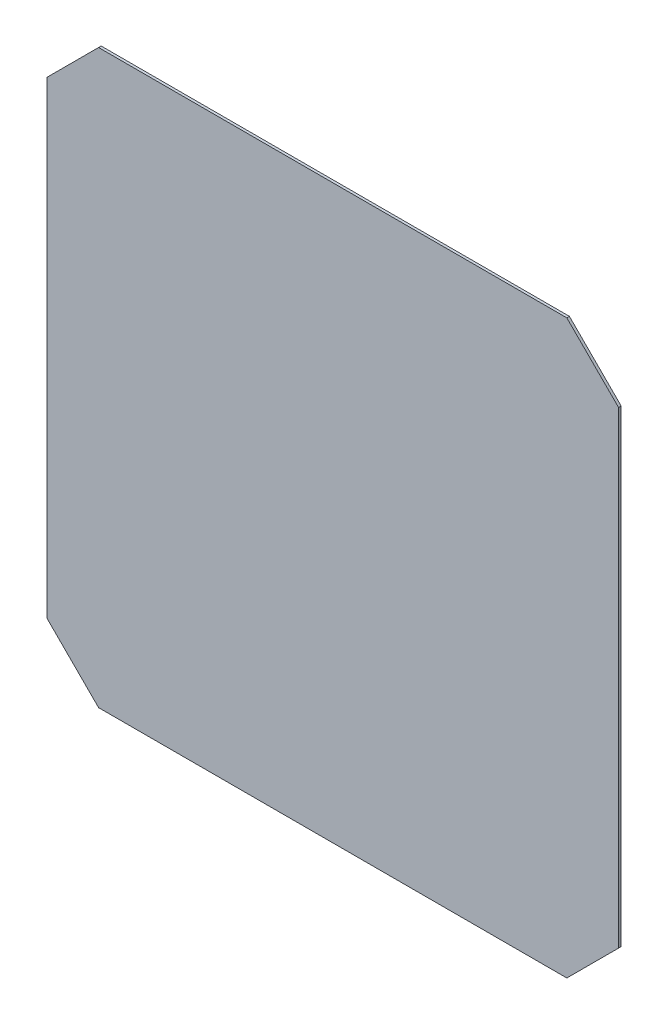
ISO-10303-21;
HEADER;
FILE_DESCRIPTION(('STEP AP214'),'2;1');
FILE_NAME('part.step','',(''),(''),'','','');
FILE_SCHEMA(('AUTOMOTIVE_DESIGN { 1 0 10303 214 1 1 1 1 }'));
ENDSEC;
DATA;
#1=APPLICATION_CONTEXT('core data for automotive mechanical design processes');
#2=APPLICATION_PROTOCOL_DEFINITION('international standard','automotive_design',2000,#1);
#3=PRODUCT_CONTEXT('',#1,'mechanical');
#4=PRODUCT('Part','Part','',(#3));
#5=PRODUCT_RELATED_PRODUCT_CATEGORY('part','',(#4));
#6=PRODUCT_DEFINITION_FORMATION('','',#4);
#7=PRODUCT_DEFINITION_CONTEXT('part definition',#1,'design');
#8=PRODUCT_DEFINITION('design','',#6,#7);
#9=PRODUCT_DEFINITION_SHAPE('','',#8);
#10=(LENGTH_UNIT() NAMED_UNIT(*) SI_UNIT(.MILLI.,.METRE.));
#11=(NAMED_UNIT(*) PLANE_ANGLE_UNIT() SI_UNIT($,.RADIAN.));
#12=(NAMED_UNIT(*) SI_UNIT($,.STERADIAN.) SOLID_ANGLE_UNIT());
#13=UNCERTAINTY_MEASURE_WITH_UNIT(LENGTH_MEASURE(1.E-05),#10,'distance_accuracy_value','');
#14=(GEOMETRIC_REPRESENTATION_CONTEXT(3) GLOBAL_UNCERTAINTY_ASSIGNED_CONTEXT((#13)) GLOBAL_UNIT_ASSIGNED_CONTEXT((#10,
#11,#12)) REPRESENTATION_CONTEXT('',''));
#15=CARTESIAN_POINT('',(0.,0.,0.));
#16=DIRECTION('',(0.,0.,1.));
#17=DIRECTION('',(1.,0.,0.));
#18=AXIS2_PLACEMENT_3D('',#15,#16,#17);
#19=CARTESIAN_POINT('',(-181.,221.,2.));
#20=DIRECTION('',(0.,-1.,0.));
#21=DIRECTION('',(1.,0.,0.));
#22=AXIS2_PLACEMENT_3D('',#19,#20,#21);
#23=PLANE('',#22);
#24=DIRECTION('',(-1.,0.,0.));
#25=VECTOR('',#24,1.);
#26=CARTESIAN_POINT('',(-181.,221.,0.));
#27=LINE('',#26,#25);
#28=CARTESIAN_POINT('',(181.,221.,0.));
#29=VERTEX_POINT('',#28);
#30=CARTESIAN_POINT('',(-181.,221.,0.));
#31=VERTEX_POINT('',#30);
#32=EDGE_CURVE('E195',#29,#31,#27,.T.);
#33=ORIENTED_EDGE('',*,*,#32,.T.);
#34=DIRECTION('',(0.,0.,-1.));
#35=VECTOR('',#34,1.);
#36=CARTESIAN_POINT('',(-181.,221.,2.));
#37=LINE('',#36,#35);
#38=CARTESIAN_POINT('',(-181.,221.,2.));
#39=VERTEX_POINT('',#38);
#40=EDGE_CURVE('E12',#39,#31,#37,.T.);
#41=ORIENTED_EDGE('',*,*,#40,.F.);
#42=DIRECTION('',(-1.,0.,0.));
#43=VECTOR('',#42,1.);
#44=CARTESIAN_POINT('',(-181.,221.,2.));
#45=LINE('',#44,#43);
#46=CARTESIAN_POINT('',(181.,221.,2.));
#47=VERTEX_POINT('',#46);
#48=EDGE_CURVE('E160',#47,#39,#45,.T.);
#49=ORIENTED_EDGE('',*,*,#48,.F.);
#50=DIRECTION('',(0.,0.,-1.));
#51=VECTOR('',#50,1.);
#52=CARTESIAN_POINT('',(181.,221.,2.));
#53=LINE('',#52,#51);
#54=EDGE_CURVE('E135',#47,#29,#53,.T.);
#55=ORIENTED_EDGE('',*,*,#54,.T.);
#56=EDGE_LOOP('',(#33,#41,#49,#55));
#57=FACE_BOUND('',#56,.T.);
#58=ADVANCED_FACE('F40',(#57),#23,.F.);
#59=CARTESIAN_POINT('',(-221.,181.,2.));
#60=DIRECTION('',(0.707106781186547,-0.707106781186548,0.));
#61=DIRECTION('',(0.707106781186548,0.707106781186547,0.));
#62=AXIS2_PLACEMENT_3D('',#59,#60,#61);
#63=PLANE('',#62);
#64=DIRECTION('',(-0.707106781186548,-0.707106781186547,0.));
#65=VECTOR('',#64,1.);
#66=CARTESIAN_POINT('',(-221.,181.,0.));
#67=LINE('',#66,#65);
#68=CARTESIAN_POINT('',(-221.,181.,0.));
#69=VERTEX_POINT('',#68);
#70=EDGE_CURVE('E189',#31,#69,#67,.T.);
#71=ORIENTED_EDGE('',*,*,#70,.T.);
#72=DIRECTION('',(0.,0.,-1.));
#73=VECTOR('',#72,1.);
#74=CARTESIAN_POINT('',(-221.,181.,2.));
#75=LINE('',#74,#73);
#76=CARTESIAN_POINT('',(-221.,181.,2.));
#77=VERTEX_POINT('',#76);
#78=EDGE_CURVE('E48',#77,#69,#75,.T.);
#79=ORIENTED_EDGE('',*,*,#78,.F.);
#80=DIRECTION('',(-0.707106781186548,-0.707106781186547,0.));
#81=VECTOR('',#80,1.);
#82=CARTESIAN_POINT('',(-221.,181.,2.));
#83=LINE('',#82,#81);
#84=EDGE_CURVE('E99',#39,#77,#83,.T.);
#85=ORIENTED_EDGE('',*,*,#84,.F.);
#86=ORIENTED_EDGE('',*,*,#40,.T.);
#87=EDGE_LOOP('',(#71,#79,#85,#86));
#88=FACE_BOUND('',#87,.T.);
#89=ADVANCED_FACE('F214',(#88),#63,.F.);
#90=CARTESIAN_POINT('',(-221.,181.,2.));
#91=DIRECTION('',(1.,0.,0.));
#92=DIRECTION('',(0.,1.,0.));
#93=AXIS2_PLACEMENT_3D('',#90,#91,#92);
#94=PLANE('',#93);
#95=DIRECTION('',(0.,-1.,0.));
#96=VECTOR('',#95,1.);
#97=CARTESIAN_POINT('',(-221.,181.,0.));
#98=LINE('',#97,#96);
#99=CARTESIAN_POINT('',(-221.,-181.,0.));
#100=VERTEX_POINT('',#99);
#101=EDGE_CURVE('E184',#69,#100,#98,.T.);
#102=ORIENTED_EDGE('',*,*,#101,.T.);
#103=DIRECTION('',(0.,0.,-1.));
#104=VECTOR('',#103,1.);
#105=CARTESIAN_POINT('',(-221.,-181.,2.));
#106=LINE('',#105,#104);
#107=CARTESIAN_POINT('',(-221.,-181.,2.));
#108=VERTEX_POINT('',#107);
#109=EDGE_CURVE('E176',#108,#100,#106,.T.);
#110=ORIENTED_EDGE('',*,*,#109,.F.);
#111=DIRECTION('',(0.,-1.,0.));
#112=VECTOR('',#111,1.);
#113=CARTESIAN_POINT('',(-221.,181.,2.));
#114=LINE('',#113,#112);
#115=EDGE_CURVE('E152',#77,#108,#114,.T.);
#116=ORIENTED_EDGE('',*,*,#115,.F.);
#117=ORIENTED_EDGE('',*,*,#78,.T.);
#118=EDGE_LOOP('',(#102,#110,#116,#117));
#119=FACE_BOUND('',#118,.T.);
#120=ADVANCED_FACE('F182',(#119),#94,.F.);
#121=CARTESIAN_POINT('',(-221.,-181.,2.));
#122=DIRECTION('',(0.707106781186548,0.707106781186547,0.));
#123=DIRECTION('',(-0.707106781186547,0.707106781186548,0.));
#124=AXIS2_PLACEMENT_3D('',#121,#122,#123);
#125=PLANE('',#124);
#126=DIRECTION('',(0.707106781186547,-0.707106781186548,0.));
#127=VECTOR('',#126,1.);
#128=CARTESIAN_POINT('',(-221.,-181.,0.));
#129=LINE('',#128,#127);
#130=CARTESIAN_POINT('',(-181.,-221.,0.));
#131=VERTEX_POINT('',#130);
#132=EDGE_CURVE('E191',#100,#131,#129,.T.);
#133=ORIENTED_EDGE('',*,*,#132,.T.);
#134=DIRECTION('',(0.,0.,-1.));
#135=VECTOR('',#134,1.);
#136=CARTESIAN_POINT('',(-181.,-221.,2.));
#137=LINE('',#136,#135);
#138=CARTESIAN_POINT('',(-181.,-221.,2.));
#139=VERTEX_POINT('',#138);
#140=EDGE_CURVE('E173',#139,#131,#137,.T.);
#141=ORIENTED_EDGE('',*,*,#140,.F.);
#142=DIRECTION('',(0.707106781186547,-0.707106781186548,0.));
#143=VECTOR('',#142,1.);
#144=CARTESIAN_POINT('',(-221.,-181.,2.));
#145=LINE('',#144,#143);
#146=EDGE_CURVE('E148',#108,#139,#145,.T.);
#147=ORIENTED_EDGE('',*,*,#146,.F.);
#148=ORIENTED_EDGE('',*,*,#109,.T.);
#149=EDGE_LOOP('',(#133,#141,#147,#148));
#150=FACE_BOUND('',#149,.T.);
#151=ADVANCED_FACE('F221',(#150),#125,.F.);
#152=CARTESIAN_POINT('',(-181.,-221.,2.));
#153=DIRECTION('',(0.,1.,0.));
#154=DIRECTION('',(0.,0.,1.));
#155=AXIS2_PLACEMENT_3D('',#152,#153,#154);
#156=PLANE('',#155);
#157=DIRECTION('',(1.,0.,0.));
#158=VECTOR('',#157,1.);
#159=CARTESIAN_POINT('',(-181.,-221.,0.));
#160=LINE('',#159,#158);
#161=CARTESIAN_POINT('',(181.,-221.,0.));
#162=VERTEX_POINT('',#161);
#163=EDGE_CURVE('E193',#131,#162,#160,.T.);
#164=ORIENTED_EDGE('',*,*,#163,.T.);
#165=DIRECTION('',(0.,0.,-1.));
#166=VECTOR('',#165,1.);
#167=CARTESIAN_POINT('',(181.,-221.,2.));
#168=LINE('',#167,#166);
#169=CARTESIAN_POINT('',(181.,-221.,2.));
#170=VERTEX_POINT('',#169);
#171=EDGE_CURVE('E128',#170,#162,#168,.T.);
#172=ORIENTED_EDGE('',*,*,#171,.F.);
#173=DIRECTION('',(1.,0.,0.));
#174=VECTOR('',#173,1.);
#175=CARTESIAN_POINT('',(-181.,-221.,2.));
#176=LINE('',#175,#174);
#177=EDGE_CURVE('E118',#139,#170,#176,.T.);
#178=ORIENTED_EDGE('',*,*,#177,.F.);
#179=ORIENTED_EDGE('',*,*,#140,.T.);
#180=EDGE_LOOP('',(#164,#172,#178,#179));
#181=FACE_BOUND('',#180,.T.);
#182=ADVANCED_FACE('F199',(#181),#156,.F.);
#183=CARTESIAN_POINT('',(181.,-221.,2.));
#184=DIRECTION('',(-0.707106781186548,0.707106781186547,0.));
#185=DIRECTION('',(-0.707106781186547,-0.707106781186548,0.));
#186=AXIS2_PLACEMENT_3D('',#183,#184,#185);
#187=PLANE('',#186);
#188=DIRECTION('',(0.707106781186547,0.707106781186548,0.));
#189=VECTOR('',#188,1.);
#190=CARTESIAN_POINT('',(181.,-221.,0.));
#191=LINE('',#190,#189);
#192=CARTESIAN_POINT('',(221.,-181.,0.));
#193=VERTEX_POINT('',#192);
#194=EDGE_CURVE('E127',#162,#193,#191,.T.);
#195=ORIENTED_EDGE('',*,*,#194,.T.);
#196=DIRECTION('',(0.,0.,-1.));
#197=VECTOR('',#196,1.);
#198=CARTESIAN_POINT('',(221.,-181.,2.));
#199=LINE('',#198,#197);
#200=CARTESIAN_POINT('',(221.,-181.,2.));
#201=VERTEX_POINT('',#200);
#202=EDGE_CURVE('E124',#201,#193,#199,.T.);
#203=ORIENTED_EDGE('',*,*,#202,.F.);
#204=DIRECTION('',(0.707106781186547,0.707106781186548,0.));
#205=VECTOR('',#204,1.);
#206=CARTESIAN_POINT('',(181.,-221.,2.));
#207=LINE('',#206,#205);
#208=EDGE_CURVE('E112',#170,#201,#207,.T.);
#209=ORIENTED_EDGE('',*,*,#208,.F.);
#210=ORIENTED_EDGE('',*,*,#171,.T.);
#211=EDGE_LOOP('',(#195,#203,#209,#210));
#212=FACE_BOUND('',#211,.T.);
#213=ADVANCED_FACE('F125',(#212),#187,.F.);
#214=CARTESIAN_POINT('',(221.,181.,2.));
#215=DIRECTION('',(-1.,0.,0.));
#216=DIRECTION('',(0.,-1.,0.));
#217=AXIS2_PLACEMENT_3D('',#214,#215,#216);
#218=PLANE('',#217);
#219=DIRECTION('',(0.,1.,0.));
#220=VECTOR('',#219,1.);
#221=CARTESIAN_POINT('',(221.,181.,0.));
#222=LINE('',#221,#220);
#223=CARTESIAN_POINT('',(221.,181.,0.));
#224=VERTEX_POINT('',#223);
#225=EDGE_CURVE('E85',#193,#224,#222,.T.);
#226=ORIENTED_EDGE('',*,*,#225,.T.);
#227=DIRECTION('',(0.,0.,-1.));
#228=VECTOR('',#227,1.);
#229=CARTESIAN_POINT('',(221.,181.,2.));
#230=LINE('',#229,#228);
#231=CARTESIAN_POINT('',(221.,181.,2.));
#232=VERTEX_POINT('',#231);
#233=EDGE_CURVE('E129',#232,#224,#230,.T.);
#234=ORIENTED_EDGE('',*,*,#233,.F.);
#235=DIRECTION('',(0.,1.,0.));
#236=VECTOR('',#235,1.);
#237=CARTESIAN_POINT('',(221.,181.,2.));
#238=LINE('',#237,#236);
#239=EDGE_CURVE('E116',#201,#232,#238,.T.);
#240=ORIENTED_EDGE('',*,*,#239,.F.);
#241=ORIENTED_EDGE('',*,*,#202,.T.);
#242=EDGE_LOOP('',(#226,#234,#240,#241));
#243=FACE_BOUND('',#242,.T.);
#244=ADVANCED_FACE('F131',(#243),#218,.F.);
#245=CARTESIAN_POINT('',(181.,221.,2.));
#246=DIRECTION('',(-0.707106781186547,-0.707106781186548,0.));
#247=DIRECTION('',(0.707106781186548,-0.707106781186547,0.));
#248=AXIS2_PLACEMENT_3D('',#245,#246,#247);
#249=PLANE('',#248);
#250=DIRECTION('',(-0.707106781186548,0.707106781186547,0.));
#251=VECTOR('',#250,1.);
#252=CARTESIAN_POINT('',(181.,221.,0.));
#253=LINE('',#252,#251);
#254=EDGE_CURVE('E91',#224,#29,#253,.T.);
#255=ORIENTED_EDGE('',*,*,#254,.T.);
#256=ORIENTED_EDGE('',*,*,#54,.F.);
#257=DIRECTION('',(-0.707106781186548,0.707106781186547,0.));
#258=VECTOR('',#257,1.);
#259=CARTESIAN_POINT('',(181.,221.,2.));
#260=LINE('',#259,#258);
#261=EDGE_CURVE('E56',#232,#47,#260,.T.);
#262=ORIENTED_EDGE('',*,*,#261,.F.);
#263=ORIENTED_EDGE('',*,*,#233,.T.);
#264=EDGE_LOOP('',(#255,#256,#262,#263));
#265=FACE_BOUND('',#264,.T.);
#266=ADVANCED_FACE('F203',(#265),#249,.F.);
#267=CARTESIAN_POINT('',(0.,0.,2.));
#268=DIRECTION('',(0.,0.,-1.));
#269=DIRECTION('',(-1.,0.,0.));
#270=AXIS2_PLACEMENT_3D('',#267,#268,#269);
#271=PLANE('',#270);
#272=ORIENTED_EDGE('',*,*,#48,.T.);
#273=ORIENTED_EDGE('',*,*,#84,.T.);
#274=ORIENTED_EDGE('',*,*,#115,.T.);
#275=ORIENTED_EDGE('',*,*,#146,.T.);
#276=ORIENTED_EDGE('',*,*,#177,.T.);
#277=ORIENTED_EDGE('',*,*,#208,.T.);
#278=ORIENTED_EDGE('',*,*,#239,.T.);
#279=ORIENTED_EDGE('',*,*,#261,.T.);
#280=EDGE_LOOP('',(#272,#273,#274,#275,#276,#277,#278,#279));
#281=FACE_BOUND('',#280,.T.);
#282=ADVANCED_FACE('F114',(#281),#271,.F.);
#283=CARTESIAN_POINT('',(0.,0.,0.));
#284=DIRECTION('',(0.,0.,-1.));
#285=DIRECTION('',(-1.,0.,0.));
#286=AXIS2_PLACEMENT_3D('',#283,#284,#285);
#287=PLANE('',#286);
#288=ORIENTED_EDGE('',*,*,#32,.F.);
#289=ORIENTED_EDGE('',*,*,#254,.F.);
#290=ORIENTED_EDGE('',*,*,#225,.F.);
#291=ORIENTED_EDGE('',*,*,#194,.F.);
#292=ORIENTED_EDGE('',*,*,#163,.F.);
#293=ORIENTED_EDGE('',*,*,#132,.F.);
#294=ORIENTED_EDGE('',*,*,#101,.F.);
#295=ORIENTED_EDGE('',*,*,#70,.F.);
#296=EDGE_LOOP('',(#288,#289,#290,#291,#292,#293,#294,#295));
#297=FACE_BOUND('',#296,.T.);
#298=ADVANCED_FACE('F188',(#297),#287,.T.);
#299=CLOSED_SHELL('',(#58,#89,#120,#151,#182,#213,#244,#266,#282,#298));
#300=MANIFOLD_SOLID_BREP('B2',#299);
#301=ADVANCED_BREP_SHAPE_REPRESENTATION('',(#18,#300),#14);
#302=SHAPE_DEFINITION_REPRESENTATION(#9,#301);
ENDSEC;
END-ISO-10303-21;
